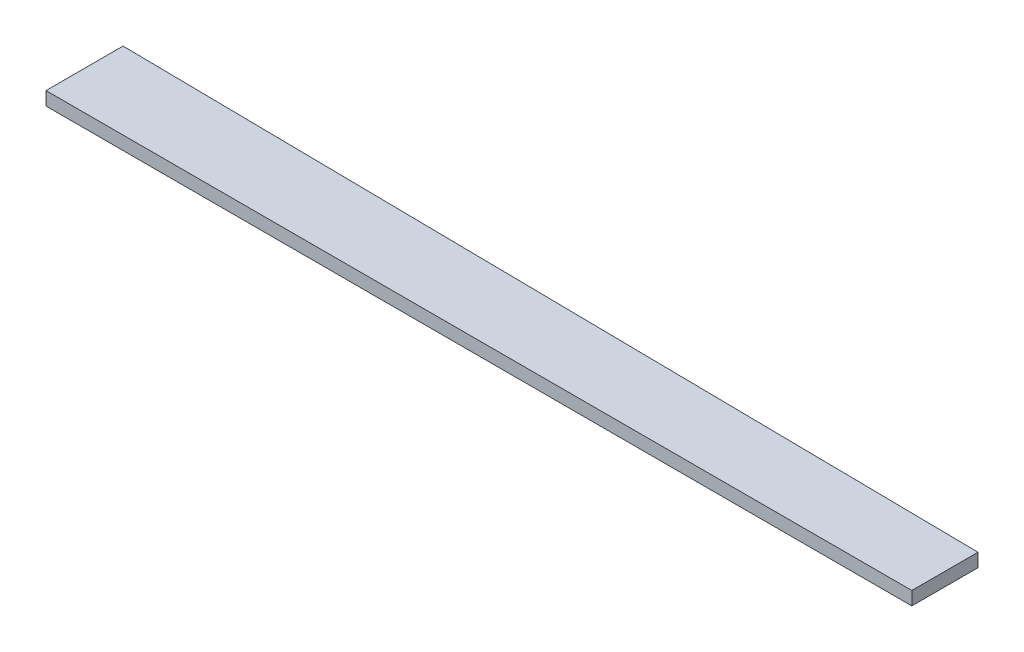
ISO-10303-21;
HEADER;
FILE_DESCRIPTION(('STEP AP214'),'2;1');
FILE_NAME('part.step','',(''),(''),'','','');
FILE_SCHEMA(('AUTOMOTIVE_DESIGN { 1 0 10303 214 1 1 1 1 }'));
ENDSEC;
DATA;
#1=APPLICATION_CONTEXT('core data for automotive mechanical design processes');
#2=APPLICATION_PROTOCOL_DEFINITION('international standard','automotive_design',2000,#1);
#3=PRODUCT_CONTEXT('',#1,'mechanical');
#4=PRODUCT('Part','Part','',(#3));
#5=PRODUCT_RELATED_PRODUCT_CATEGORY('part','',(#4));
#6=PRODUCT_DEFINITION_FORMATION('','',#4);
#7=PRODUCT_DEFINITION_CONTEXT('part definition',#1,'design');
#8=PRODUCT_DEFINITION('design','',#6,#7);
#9=PRODUCT_DEFINITION_SHAPE('','',#8);
#10=(LENGTH_UNIT() NAMED_UNIT(*) SI_UNIT(.MILLI.,.METRE.));
#11=(NAMED_UNIT(*) PLANE_ANGLE_UNIT() SI_UNIT($,.RADIAN.));
#12=(NAMED_UNIT(*) SI_UNIT($,.STERADIAN.) SOLID_ANGLE_UNIT());
#13=UNCERTAINTY_MEASURE_WITH_UNIT(LENGTH_MEASURE(1.E-05),#10,'distance_accuracy_value','');
#14=(GEOMETRIC_REPRESENTATION_CONTEXT(3) GLOBAL_UNCERTAINTY_ASSIGNED_CONTEXT((#13)) GLOBAL_UNIT_ASSIGNED_CONTEXT((#10,
#11,#12)) REPRESENTATION_CONTEXT('',''));
#15=CARTESIAN_POINT('',(0.,0.,0.));
#16=DIRECTION('',(0.,0.,1.));
#17=DIRECTION('',(1.,0.,0.));
#18=AXIS2_PLACEMENT_3D('',#15,#16,#17);
#19=CARTESIAN_POINT('',(129.087879032856,2.,-9.86527450806263));
#20=DIRECTION('',(-0.0125701355826904,0.,0.999920992724642));
#21=DIRECTION('',(0.999920992724642,0.,0.0125701355826904));
#22=AXIS2_PLACEMENT_3D('',#19,#20,#21);
#23=PLANE('',#22);
#24=DIRECTION('',(-0.999920992724642,0.,-0.0125701355826904));
#25=VECTOR('',#24,1.);
#26=CARTESIAN_POINT('',(129.087879032856,0.,-9.86527450806263));
#27=LINE('',#26,#25);
#28=CARTESIAN_POINT('',(129.087879032856,0.,-9.86527450806263));
#29=VERTEX_POINT('',#28);
#30=CARTESIAN_POINT('',(0.,0.,-11.4880548610418));
#31=VERTEX_POINT('',#30);
#32=EDGE_CURVE('E107',#29,#31,#27,.T.);
#33=ORIENTED_EDGE('',*,*,#32,.T.);
#34=DIRECTION('',(0.,-1.,0.));
#35=VECTOR('',#34,1.);
#36=CARTESIAN_POINT('',(0.,2.,-11.4880548610418));
#37=LINE('',#36,#35);
#38=CARTESIAN_POINT('',(0.,2.,-11.4880548610418));
#39=VERTEX_POINT('',#38);
#40=EDGE_CURVE('E11',#39,#31,#37,.T.);
#41=ORIENTED_EDGE('',*,*,#40,.F.);
#42=DIRECTION('',(-0.999920992724642,0.,-0.0125701355826904));
#43=VECTOR('',#42,1.);
#44=CARTESIAN_POINT('',(129.087879032856,2.,-9.86527450806263));
#45=LINE('',#44,#43);
#46=CARTESIAN_POINT('',(129.087879032856,2.,-9.86527450806263));
#47=VERTEX_POINT('',#46);
#48=EDGE_CURVE('E91',#47,#39,#45,.T.);
#49=ORIENTED_EDGE('',*,*,#48,.F.);
#50=DIRECTION('',(0.,-1.,0.));
#51=VECTOR('',#50,1.);
#52=CARTESIAN_POINT('',(129.087879032856,2.,-9.86527450806263));
#53=LINE('',#52,#51);
#54=EDGE_CURVE('E103',#47,#29,#53,.T.);
#55=ORIENTED_EDGE('',*,*,#54,.T.);
#56=EDGE_LOOP('',(#33,#41,#49,#55));
#57=FACE_BOUND('',#56,.T.);
#58=ADVANCED_FACE('F39',(#57),#23,.F.);
#59=CARTESIAN_POINT('',(0.,2.,-11.4880548610418));
#60=DIRECTION('',(1.,0.,0.));
#61=DIRECTION('',(0.,0.,-1.));
#62=AXIS2_PLACEMENT_3D('',#59,#60,#61);
#63=PLANE('',#62);
#64=DIRECTION('',(0.,0.,1.));
#65=VECTOR('',#64,1.);
#66=CARTESIAN_POINT('',(0.,0.,-11.4880548610418));
#67=LINE('',#66,#65);
#68=CARTESIAN_POINT('',(0.,0.,0.));
#69=VERTEX_POINT('',#68);
#70=EDGE_CURVE('E96',#31,#69,#67,.T.);
#71=ORIENTED_EDGE('',*,*,#70,.T.);
#72=DIRECTION('',(0.,-1.,0.));
#73=VECTOR('',#72,1.);
#74=CARTESIAN_POINT('',(0.,2.,0.));
#75=LINE('',#74,#73);
#76=CARTESIAN_POINT('',(0.,2.,0.));
#77=VERTEX_POINT('',#76);
#78=EDGE_CURVE('E48',#77,#69,#75,.T.);
#79=ORIENTED_EDGE('',*,*,#78,.F.);
#80=DIRECTION('',(0.,0.,1.));
#81=VECTOR('',#80,1.);
#82=CARTESIAN_POINT('',(0.,2.,-11.4880548610418));
#83=LINE('',#82,#81);
#84=EDGE_CURVE('E86',#39,#77,#83,.T.);
#85=ORIENTED_EDGE('',*,*,#84,.F.);
#86=ORIENTED_EDGE('',*,*,#40,.T.);
#87=EDGE_LOOP('',(#71,#79,#85,#86));
#88=FACE_BOUND('',#87,.T.);
#89=ADVANCED_FACE('F95',(#88),#63,.F.);
#90=CARTESIAN_POINT('',(0.,2.,0.));
#91=DIRECTION('',(0.,0.,-1.));
#92=DIRECTION('',(-1.,0.,0.));
#93=AXIS2_PLACEMENT_3D('',#90,#91,#92);
#94=PLANE('',#93);
#95=DIRECTION('',(1.,0.,0.));
#96=VECTOR('',#95,1.);
#97=CARTESIAN_POINT('',(0.,0.,0.));
#98=LINE('',#97,#96);
#99=CARTESIAN_POINT('',(129.087879032856,0.,0.));
#100=VERTEX_POINT('',#99);
#101=EDGE_CURVE('E73',#69,#100,#98,.T.);
#102=ORIENTED_EDGE('',*,*,#101,.T.);
#103=DIRECTION('',(0.,-1.,0.));
#104=VECTOR('',#103,1.);
#105=CARTESIAN_POINT('',(129.087879032856,2.,0.));
#106=LINE('',#105,#104);
#107=CARTESIAN_POINT('',(129.087879032856,2.,0.));
#108=VERTEX_POINT('',#107);
#109=EDGE_CURVE('E98',#108,#100,#106,.T.);
#110=ORIENTED_EDGE('',*,*,#109,.F.);
#111=DIRECTION('',(1.,0.,0.));
#112=VECTOR('',#111,1.);
#113=CARTESIAN_POINT('',(0.,2.,0.));
#114=LINE('',#113,#112);
#115=EDGE_CURVE('E89',#77,#108,#114,.T.);
#116=ORIENTED_EDGE('',*,*,#115,.F.);
#117=ORIENTED_EDGE('',*,*,#78,.T.);
#118=EDGE_LOOP('',(#102,#110,#116,#117));
#119=FACE_BOUND('',#118,.T.);
#120=ADVANCED_FACE('F99',(#119),#94,.F.);
#121=CARTESIAN_POINT('',(129.087879032856,2.,0.));
#122=DIRECTION('',(-1.,0.,0.));
#123=DIRECTION('',(0.,0.,1.));
#124=AXIS2_PLACEMENT_3D('',#121,#122,#123);
#125=PLANE('',#124);
#126=DIRECTION('',(0.,0.,-1.));
#127=VECTOR('',#126,1.);
#128=CARTESIAN_POINT('',(129.087879032856,0.,0.));
#129=LINE('',#128,#127);
#130=EDGE_CURVE('E79',#100,#29,#129,.T.);
#131=ORIENTED_EDGE('',*,*,#130,.T.);
#132=ORIENTED_EDGE('',*,*,#54,.F.);
#133=DIRECTION('',(0.,0.,-1.));
#134=VECTOR('',#133,1.);
#135=CARTESIAN_POINT('',(129.087879032856,2.,0.));
#136=LINE('',#135,#134);
#137=EDGE_CURVE('E56',#108,#47,#136,.T.);
#138=ORIENTED_EDGE('',*,*,#137,.F.);
#139=ORIENTED_EDGE('',*,*,#109,.T.);
#140=EDGE_LOOP('',(#131,#132,#138,#139));
#141=FACE_BOUND('',#140,.T.);
#142=ADVANCED_FACE('F120',(#141),#125,.F.);
#143=CARTESIAN_POINT('',(0.,2.,0.));
#144=DIRECTION('',(0.,1.,0.));
#145=DIRECTION('',(0.,0.,1.));
#146=AXIS2_PLACEMENT_3D('',#143,#144,#145);
#147=PLANE('',#146);
#148=ORIENTED_EDGE('',*,*,#48,.T.);
#149=ORIENTED_EDGE('',*,*,#84,.T.);
#150=ORIENTED_EDGE('',*,*,#115,.T.);
#151=ORIENTED_EDGE('',*,*,#137,.T.);
#152=EDGE_LOOP('',(#148,#149,#150,#151));
#153=FACE_BOUND('',#152,.T.);
#154=ADVANCED_FACE('F87',(#153),#147,.T.);
#155=CARTESIAN_POINT('',(0.,0.,0.));
#156=DIRECTION('',(0.,1.,0.));
#157=DIRECTION('',(0.,0.,1.));
#158=AXIS2_PLACEMENT_3D('',#155,#156,#157);
#159=PLANE('',#158);
#160=ORIENTED_EDGE('',*,*,#32,.F.);
#161=ORIENTED_EDGE('',*,*,#130,.F.);
#162=ORIENTED_EDGE('',*,*,#101,.F.);
#163=ORIENTED_EDGE('',*,*,#70,.F.);
#164=EDGE_LOOP('',(#160,#161,#162,#163));
#165=FACE_BOUND('',#164,.T.);
#166=ADVANCED_FACE('F123',(#165),#159,.F.);
#167=CLOSED_SHELL('',(#58,#89,#120,#142,#154,#166));
#168=MANIFOLD_SOLID_BREP('B2',#167);
#169=ADVANCED_BREP_SHAPE_REPRESENTATION('',(#18,#168),#14);
#170=SHAPE_DEFINITION_REPRESENTATION(#9,#169);
ENDSEC;
END-ISO-10303-21;
